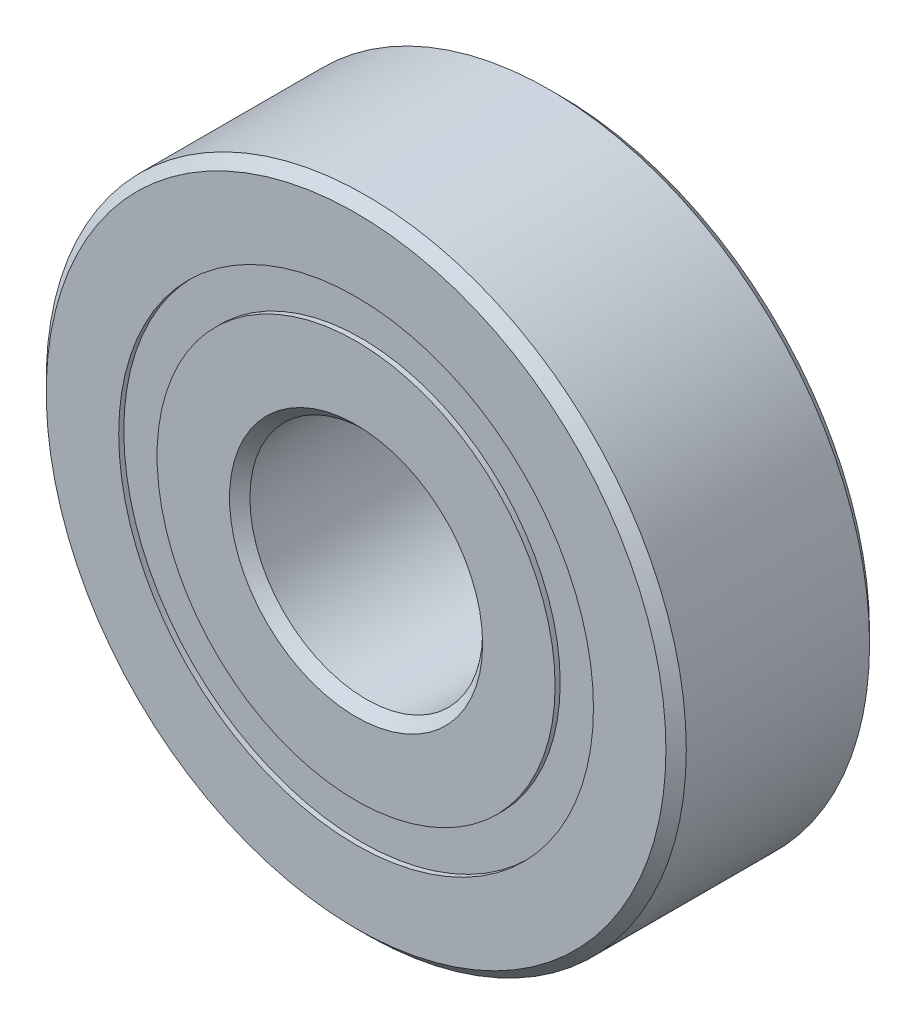
ISO-10303-21;
HEADER;
FILE_DESCRIPTION(('STEP AP214'),'2;1');
FILE_NAME('part.step','',(''),(''),'','','');
FILE_SCHEMA(('AUTOMOTIVE_DESIGN { 1 0 10303 214 1 1 1 1 }'));
ENDSEC;
DATA;
#1=APPLICATION_CONTEXT('core data for automotive mechanical design processes');
#2=APPLICATION_PROTOCOL_DEFINITION('international standard','automotive_design',2000,#1);
#3=PRODUCT_CONTEXT('',#1,'mechanical');
#4=PRODUCT('Part','Part','',(#3));
#5=PRODUCT_RELATED_PRODUCT_CATEGORY('part','',(#4));
#6=PRODUCT_DEFINITION_FORMATION('','',#4);
#7=PRODUCT_DEFINITION_CONTEXT('part definition',#1,'design');
#8=PRODUCT_DEFINITION('design','',#6,#7);
#9=PRODUCT_DEFINITION_SHAPE('','',#8);
#10=(LENGTH_UNIT() NAMED_UNIT(*) SI_UNIT(.MILLI.,.METRE.));
#11=(NAMED_UNIT(*) PLANE_ANGLE_UNIT() SI_UNIT($,.RADIAN.));
#12=(NAMED_UNIT(*) SI_UNIT($,.STERADIAN.) SOLID_ANGLE_UNIT());
#13=UNCERTAINTY_MEASURE_WITH_UNIT(LENGTH_MEASURE(1.E-05),#10,'distance_accuracy_value','');
#14=(GEOMETRIC_REPRESENTATION_CONTEXT(3) GLOBAL_UNCERTAINTY_ASSIGNED_CONTEXT((#13)) GLOBAL_UNIT_ASSIGNED_CONTEXT((#10,
#11,#12)) REPRESENTATION_CONTEXT('',''));
#15=CARTESIAN_POINT('',(0.,0.,0.));
#16=DIRECTION('',(0.,0.,1.));
#17=DIRECTION('',(1.,0.,0.));
#18=AXIS2_PLACEMENT_3D('',#15,#16,#17);
#19=CARTESIAN_POINT('',(0.,8.15934065934066,-3.325));
#20=DIRECTION('',(0.,0.,1.));
#21=DIRECTION('',(1.,0.,0.));
#22=AXIS2_PLACEMENT_3D('',#19,#20,#21);
#23=PLANE('',#22);
#24=CARTESIAN_POINT('',(0.,0.,-3.325));
#25=DIRECTION('',(0.,0.,1.));
#26=DIRECTION('',(1.,0.,0.));
#27=AXIS2_PLACEMENT_3D('',#24,#25,#26);
#28=CIRCLE('',#27,8.15934065934066);
#29=CARTESIAN_POINT('',(8.15934065934066,0.,-3.325));
#30=VERTEX_POINT('',#29);
#31=EDGE_CURVE('E70',#30,#30,#28,.T.);
#32=ORIENTED_EDGE('',*,*,#31,.F.);
#33=EDGE_LOOP('',(#32));
#34=FACE_BOUND('',#33,.T.);
#35=CARTESIAN_POINT('',(0.,0.,-3.325));
#36=DIRECTION('',(0.,0.,1.));
#37=DIRECTION('',(1.,0.,0.));
#38=AXIS2_PLACEMENT_3D('',#35,#36,#37);
#39=CIRCLE('',#38,6.84065934065934);
#40=CARTESIAN_POINT('',(6.84065934065934,0.,-3.325));
#41=VERTEX_POINT('',#40);
#42=EDGE_CURVE('E11',#41,#41,#39,.T.);
#43=ORIENTED_EDGE('',*,*,#42,.T.);
#44=EDGE_LOOP('',(#43));
#45=FACE_BOUND('',#44,.T.);
#46=ADVANCED_FACE('F56',(#34,#45),#23,.F.);
#47=CARTESIAN_POINT('',(0.,0.,3.5));
#48=DIRECTION('',(0.,0.,1.));
#49=DIRECTION('',(1.,0.,0.));
#50=AXIS2_PLACEMENT_3D('',#47,#48,#49);
#51=CYLINDRICAL_SURFACE('',#50,6.84065934065934);
#52=ORIENTED_EDGE('',*,*,#42,.F.);
#53=EDGE_LOOP('',(#52));
#54=FACE_BOUND('',#53,.T.);
#55=CARTESIAN_POINT('',(0.,0.,-1.68952158656809));
#56=DIRECTION('',(0.,0.,1.));
#57=DIRECTION('',(1.,0.,0.));
#58=AXIS2_PLACEMENT_3D('',#55,#56,#57);
#59=CIRCLE('',#58,6.84065934065934);
#60=CARTESIAN_POINT('',(6.84065934065934,0.,-1.68952158656809));
#61=VERTEX_POINT('',#60);
#62=EDGE_CURVE('E62',#61,#61,#59,.T.);
#63=ORIENTED_EDGE('',*,*,#62,.T.);
#64=EDGE_LOOP('',(#63));
#65=FACE_BOUND('',#64,.T.);
#66=ADVANCED_FACE('F79',(#54,#65),#51,.F.);
#67=CARTESIAN_POINT('',(0.,8.15934065934066,-1.68952158656809));
#68=DIRECTION('',(0.,0.,-1.));
#69=DIRECTION('',(-1.,0.,0.));
#70=AXIS2_PLACEMENT_3D('',#67,#68,#69);
#71=PLANE('',#70);
#72=ORIENTED_EDGE('',*,*,#62,.F.);
#73=EDGE_LOOP('',(#72));
#74=FACE_BOUND('',#73,.T.);
#75=CARTESIAN_POINT('',(0.,0.,-1.68952158656809));
#76=DIRECTION('',(0.,0.,1.));
#77=DIRECTION('',(1.,0.,0.));
#78=AXIS2_PLACEMENT_3D('',#75,#76,#77);
#79=CIRCLE('',#78,8.15934065934066);
#80=CARTESIAN_POINT('',(8.15934065934066,0.,-1.68952158656809));
#81=VERTEX_POINT('',#80);
#82=EDGE_CURVE('E66',#81,#81,#79,.T.);
#83=ORIENTED_EDGE('',*,*,#82,.T.);
#84=EDGE_LOOP('',(#83));
#85=FACE_BOUND('',#84,.T.);
#86=ADVANCED_FACE('F84',(#74,#85),#71,.F.);
#87=CARTESIAN_POINT('',(0.,0.,3.5));
#88=DIRECTION('',(0.,0.,1.));
#89=DIRECTION('',(1.,0.,0.));
#90=AXIS2_PLACEMENT_3D('',#87,#88,#89);
#91=CYLINDRICAL_SURFACE('',#90,8.15934065934066);
#92=ORIENTED_EDGE('',*,*,#82,.F.);
#93=EDGE_LOOP('',(#92));
#94=FACE_BOUND('',#93,.T.);
#95=ORIENTED_EDGE('',*,*,#31,.T.);
#96=EDGE_LOOP('',(#95));
#97=FACE_BOUND('',#96,.T.);
#98=ADVANCED_FACE('F76',(#94,#97),#91,.T.);
#99=CLOSED_SHELL('',(#46,#66,#86,#98));
#100=MANIFOLD_SOLID_BREP('B2',#99);
#101=CARTESIAN_POINT('',(0.,8.15934065934066,3.32499999999999));
#102=DIRECTION('',(0.,0.,-1.));
#103=DIRECTION('',(-1.,0.,0.));
#104=AXIS2_PLACEMENT_3D('',#101,#102,#103);
#105=PLANE('',#104);
#106=CARTESIAN_POINT('',(0.,0.,3.32499999999999));
#107=DIRECTION('',(0.,0.,1.));
#108=DIRECTION('',(1.,0.,0.));
#109=AXIS2_PLACEMENT_3D('',#106,#107,#108);
#110=CIRCLE('',#109,6.84065934065934);
#111=CARTESIAN_POINT('',(6.84065934065934,0.,3.32499999999999));
#112=VERTEX_POINT('',#111);
#113=EDGE_CURVE('E55',#112,#112,#110,.T.);
#114=ORIENTED_EDGE('',*,*,#113,.F.);
#115=EDGE_LOOP('',(#114));
#116=FACE_BOUND('',#115,.T.);
#117=CARTESIAN_POINT('',(0.,0.,3.32499999999999));
#118=DIRECTION('',(0.,0.,1.));
#119=DIRECTION('',(1.,0.,0.));
#120=AXIS2_PLACEMENT_3D('',#117,#118,#119);
#121=CIRCLE('',#120,8.15934065934066);
#122=CARTESIAN_POINT('',(8.15934065934066,0.,3.32499999999999));
#123=VERTEX_POINT('',#122);
#124=EDGE_CURVE('E133',#123,#123,#121,.T.);
#125=ORIENTED_EDGE('',*,*,#124,.T.);
#126=EDGE_LOOP('',(#125));
#127=FACE_BOUND('',#126,.T.);
#128=ADVANCED_FACE('F119',(#116,#127),#105,.F.);
#129=CARTESIAN_POINT('',(0.,0.,3.5));
#130=DIRECTION('',(0.,0.,1.));
#131=DIRECTION('',(1.,0.,0.));
#132=AXIS2_PLACEMENT_3D('',#129,#130,#131);
#133=CYLINDRICAL_SURFACE('',#132,6.84065934065934);
#134=CARTESIAN_POINT('',(0.,0.,1.68952158656808));
#135=DIRECTION('',(0.,0.,1.));
#136=DIRECTION('',(1.,0.,0.));
#137=AXIS2_PLACEMENT_3D('',#134,#135,#136);
#138=CIRCLE('',#137,6.84065934065934);
#139=CARTESIAN_POINT('',(6.84065934065934,0.,1.68952158656808));
#140=VERTEX_POINT('',#139);
#141=EDGE_CURVE('E125',#140,#140,#138,.T.);
#142=ORIENTED_EDGE('',*,*,#141,.F.);
#143=EDGE_LOOP('',(#142));
#144=FACE_BOUND('',#143,.T.);
#145=ORIENTED_EDGE('',*,*,#113,.T.);
#146=EDGE_LOOP('',(#145));
#147=FACE_BOUND('',#146,.T.);
#148=ADVANCED_FACE('F148',(#144,#147),#133,.F.);
#149=CARTESIAN_POINT('',(0.,8.15934065934066,1.68952158656808));
#150=DIRECTION('',(0.,0.,1.));
#151=DIRECTION('',(1.,0.,0.));
#152=AXIS2_PLACEMENT_3D('',#149,#150,#151);
#153=PLANE('',#152);
#154=CARTESIAN_POINT('',(0.,0.,1.68952158656808));
#155=DIRECTION('',(0.,0.,1.));
#156=DIRECTION('',(1.,0.,0.));
#157=AXIS2_PLACEMENT_3D('',#154,#155,#156);
#158=CIRCLE('',#157,8.15934065934066);
#159=CARTESIAN_POINT('',(8.15934065934066,0.,1.68952158656808));
#160=VERTEX_POINT('',#159);
#161=EDGE_CURVE('E129',#160,#160,#158,.T.);
#162=ORIENTED_EDGE('',*,*,#161,.F.);
#163=EDGE_LOOP('',(#162));
#164=FACE_BOUND('',#163,.T.);
#165=ORIENTED_EDGE('',*,*,#141,.T.);
#166=EDGE_LOOP('',(#165));
#167=FACE_BOUND('',#166,.T.);
#168=ADVANCED_FACE('F143',(#164,#167),#153,.F.);
#169=CARTESIAN_POINT('',(0.,0.,3.5));
#170=DIRECTION('',(0.,0.,1.));
#171=DIRECTION('',(1.,0.,0.));
#172=AXIS2_PLACEMENT_3D('',#169,#170,#171);
#173=CYLINDRICAL_SURFACE('',#172,8.15934065934066);
#174=ORIENTED_EDGE('',*,*,#124,.F.);
#175=EDGE_LOOP('',(#174));
#176=FACE_BOUND('',#175,.T.);
#177=ORIENTED_EDGE('',*,*,#161,.T.);
#178=EDGE_LOOP('',(#177));
#179=FACE_BOUND('',#178,.T.);
#180=ADVANCED_FACE('F140',(#176,#179),#173,.T.);
#181=CLOSED_SHELL('',(#128,#148,#168,#180));
#182=MANIFOLD_SOLID_BREP('B6',#181);
#183=CARTESIAN_POINT('',(-3.2541280433816,6.75726650926819,0.));
#184=DIRECTION('',(0.,0.,1.));
#185=DIRECTION('',(-0.433883739117546,0.900968867902425,0.));
#186=AXIS2_PLACEMENT_3D('',#183,#184,#185);
#187=SPHERICAL_SURFACE('',#186,1.68952158656808);
#188=CARTESIAN_POINT('',(-3.2541280433816,6.75726650926819,1.68952158656808));
#189=VERTEX_POINT('',#188);
#190=VERTEX_LOOP('',#189);
#191=FACE_BOUND('',#190,.T.);
#192=ADVANCED_FACE('F182',(#191),#187,.T.);
#193=CLOSED_SHELL('',(#192));
#194=MANIFOLD_SOLID_BREP('B50',#193);
#195=CARTESIAN_POINT('',(-5.86373611851017,4.67617351394057,0.));
#196=DIRECTION('',(0.,0.,1.));
#197=DIRECTION('',(-0.781831482468022,0.623489801858743,0.));
#198=AXIS2_PLACEMENT_3D('',#195,#196,#197);
#199=SPHERICAL_SURFACE('',#198,1.68952158656808);
#200=CARTESIAN_POINT('',(-5.86373611851017,4.67617351394057,1.68952158656808));
#201=VERTEX_POINT('',#200);
#202=VERTEX_LOOP('',#201);
#203=FACE_BOUND('',#202,.T.);
#204=ADVANCED_FACE('F225',(#203),#199,.T.);
#205=CLOSED_SHELL('',(#204));
#206=MANIFOLD_SOLID_BREP('B115',#205);
#207=CARTESIAN_POINT('',(-7.31195934136366,1.66890700467243,0.));
#208=DIRECTION('',(0.,0.,1.));
#209=DIRECTION('',(-0.974927912181821,0.222520933956325,0.));
#210=AXIS2_PLACEMENT_3D('',#207,#208,#209);
#211=SPHERICAL_SURFACE('',#210,1.68952158656808);
#212=CARTESIAN_POINT('',(-7.31195934136366,1.66890700467243,1.68952158656808));
#213=VERTEX_POINT('',#212);
#214=VERTEX_LOOP('',#213);
#215=FACE_BOUND('',#214,.T.);
#216=ADVANCED_FACE('F268',(#215),#211,.T.);
#217=CLOSED_SHELL('',(#216));
#218=MANIFOLD_SOLID_BREP('B178',#217);
#219=CARTESIAN_POINT('',(-7.31195934136369,-1.66890700467229,0.));
#220=DIRECTION('',(0.,0.,1.));
#221=DIRECTION('',(-0.974927912181826,-0.222520933956305,0.));
#222=AXIS2_PLACEMENT_3D('',#219,#220,#221);
#223=SPHERICAL_SURFACE('',#222,1.68952158656808);
#224=CARTESIAN_POINT('',(-7.31195934136369,-1.66890700467229,1.68952158656808));
#225=VERTEX_POINT('',#224);
#226=VERTEX_LOOP('',#225);
#227=FACE_BOUND('',#226,.T.);
#228=ADVANCED_FACE('F311',(#227),#223,.T.);
#229=CLOSED_SHELL('',(#228));
#230=MANIFOLD_SOLID_BREP('B221',#229);
#231=CARTESIAN_POINT('',(-5.86373611851026,-4.67617351394045,0.));
#232=DIRECTION('',(0.,0.,1.));
#233=DIRECTION('',(-0.781831482468035,-0.623489801858727,0.));
#234=AXIS2_PLACEMENT_3D('',#231,#232,#233);
#235=SPHERICAL_SURFACE('',#234,1.68952158656808);
#236=CARTESIAN_POINT('',(-5.86373611851026,-4.67617351394045,1.68952158656808));
#237=VERTEX_POINT('',#236);
#238=VERTEX_LOOP('',#237);
#239=FACE_BOUND('',#238,.T.);
#240=ADVANCED_FACE('F354',(#239),#235,.T.);
#241=CLOSED_SHELL('',(#240));
#242=MANIFOLD_SOLID_BREP('B264',#241);
#243=CARTESIAN_POINT('',(-3.25412804338174,-6.75726650926812,0.));
#244=DIRECTION('',(0.,0.,1.));
#245=DIRECTION('',(-0.433883739117565,-0.900968867902416,0.));
#246=AXIS2_PLACEMENT_3D('',#243,#244,#245);
#247=SPHERICAL_SURFACE('',#246,1.68952158656808);
#248=CARTESIAN_POINT('',(-3.25412804338174,-6.75726650926812,1.68952158656808));
#249=VERTEX_POINT('',#248);
#250=VERTEX_LOOP('',#249);
#251=FACE_BOUND('',#250,.T.);
#252=ADVANCED_FACE('F397',(#251),#247,.T.);
#253=CLOSED_SHELL('',(#252));
#254=MANIFOLD_SOLID_BREP('B307',#253);
#255=CARTESIAN_POINT('',(0.,-7.5,0.));
#256=DIRECTION('',(0.,0.,1.));
#257=DIRECTION('',(0.,-1.,0.));
#258=AXIS2_PLACEMENT_3D('',#255,#256,#257);
#259=SPHERICAL_SURFACE('',#258,1.68952158656808);
#260=CARTESIAN_POINT('',(0.,-7.5,1.68952158656808));
#261=VERTEX_POINT('',#260);
#262=VERTEX_LOOP('',#261);
#263=FACE_BOUND('',#262,.T.);
#264=ADVANCED_FACE('F440',(#263),#259,.T.);
#265=CLOSED_SHELL('',(#264));
#266=MANIFOLD_SOLID_BREP('B350',#265);
#267=CARTESIAN_POINT('',(3.25412804338164,-6.75726650926816,0.));
#268=DIRECTION('',(0.,0.,1.));
#269=DIRECTION('',(0.433883739117553,-0.900968867902422,0.));
#270=AXIS2_PLACEMENT_3D('',#267,#268,#269);
#271=SPHERICAL_SURFACE('',#270,1.68952158656808);
#272=CARTESIAN_POINT('',(3.25412804338164,-6.75726650926816,1.68952158656808));
#273=VERTEX_POINT('',#272);
#274=VERTEX_LOOP('',#273);
#275=FACE_BOUND('',#274,.T.);
#276=ADVANCED_FACE('F483',(#275),#271,.T.);
#277=CLOSED_SHELL('',(#276));
#278=MANIFOLD_SOLID_BREP('B393',#277);
#279=CARTESIAN_POINT('',(5.8637361185102,-4.67617351394053,0.));
#280=DIRECTION('',(0.,0.,1.));
#281=DIRECTION('',(0.781831482468027,-0.623489801858737,0.));
#282=AXIS2_PLACEMENT_3D('',#279,#280,#281);
#283=SPHERICAL_SURFACE('',#282,1.68952158656808);
#284=CARTESIAN_POINT('',(5.8637361185102,-4.67617351394053,1.68952158656808));
#285=VERTEX_POINT('',#284);
#286=VERTEX_LOOP('',#285);
#287=FACE_BOUND('',#286,.T.);
#288=ADVANCED_FACE('F526',(#287),#283,.T.);
#289=CLOSED_SHELL('',(#288));
#290=MANIFOLD_SOLID_BREP('B436',#289);
#291=CARTESIAN_POINT('',(7.31195934136367,-1.66890700467239,0.));
#292=DIRECTION('',(0.,0.,1.));
#293=DIRECTION('',(0.974927912181823,-0.222520933956318,0.));
#294=AXIS2_PLACEMENT_3D('',#291,#292,#293);
#295=SPHERICAL_SURFACE('',#294,1.68952158656808);
#296=CARTESIAN_POINT('',(7.31195934136367,-1.66890700467239,1.68952158656808));
#297=VERTEX_POINT('',#296);
#298=VERTEX_LOOP('',#297);
#299=FACE_BOUND('',#298,.T.);
#300=ADVANCED_FACE('F569',(#299),#295,.T.);
#301=CLOSED_SHELL('',(#300));
#302=MANIFOLD_SOLID_BREP('B479',#301);
#303=CARTESIAN_POINT('',(7.31195934136368,1.66890700467234,0.));
#304=DIRECTION('',(0.,0.,1.));
#305=DIRECTION('',(0.974927912181824,0.222520933956311,0.));
#306=AXIS2_PLACEMENT_3D('',#303,#304,#305);
#307=SPHERICAL_SURFACE('',#306,1.68952158656808);
#308=CARTESIAN_POINT('',(7.31195934136368,1.66890700467234,1.68952158656808));
#309=VERTEX_POINT('',#308);
#310=VERTEX_LOOP('',#309);
#311=FACE_BOUND('',#310,.T.);
#312=ADVANCED_FACE('F612',(#311),#307,.T.);
#313=CLOSED_SHELL('',(#312));
#314=MANIFOLD_SOLID_BREP('B522',#313);
#315=CARTESIAN_POINT('',(5.86373611851023,4.67617351394049,0.));
#316=DIRECTION('',(0.,0.,1.));
#317=DIRECTION('',(0.781831482468031,0.623489801858732,0.));
#318=AXIS2_PLACEMENT_3D('',#315,#316,#317);
#319=SPHERICAL_SURFACE('',#318,1.68952158656808);
#320=CARTESIAN_POINT('',(5.86373611851023,4.67617351394049,1.68952158656808));
#321=VERTEX_POINT('',#320);
#322=VERTEX_LOOP('',#321);
#323=FACE_BOUND('',#322,.T.);
#324=ADVANCED_FACE('F655',(#323),#319,.T.);
#325=CLOSED_SHELL('',(#324));
#326=MANIFOLD_SOLID_BREP('B565',#325);
#327=CARTESIAN_POINT('',(3.25412804338169,6.75726650926814,0.));
#328=DIRECTION('',(0.,0.,1.));
#329=DIRECTION('',(0.433883739117559,0.900968867902419,0.));
#330=AXIS2_PLACEMENT_3D('',#327,#328,#329);
#331=SPHERICAL_SURFACE('',#330,1.68952158656808);
#332=CARTESIAN_POINT('',(3.25412804338169,6.75726650926814,1.68952158656808));
#333=VERTEX_POINT('',#332);
#334=VERTEX_LOOP('',#333);
#335=FACE_BOUND('',#334,.T.);
#336=ADVANCED_FACE('F698',(#335),#331,.T.);
#337=CLOSED_SHELL('',(#336));
#338=MANIFOLD_SOLID_BREP('B608',#337);
#339=CARTESIAN_POINT('',(0.,7.5,0.));
#340=DIRECTION('',(0.,0.,1.));
#341=DIRECTION('',(0.,1.,0.));
#342=AXIS2_PLACEMENT_3D('',#339,#340,#341);
#343=SPHERICAL_SURFACE('',#342,1.68952158656808);
#344=CARTESIAN_POINT('',(0.,7.5,1.68952158656808));
#345=VERTEX_POINT('',#344);
#346=VERTEX_LOOP('',#345);
#347=FACE_BOUND('',#346,.T.);
#348=ADVANCED_FACE('F743',(#347),#343,.T.);
#349=CLOSED_SHELL('',(#348));
#350=MANIFOLD_SOLID_BREP('B651',#349);
#351=CARTESIAN_POINT('',(0.,6.84065934065934,3.5));
#352=DIRECTION('',(0.,0.,-1.));
#353=DIRECTION('',(-1.,0.,0.));
#354=AXIS2_PLACEMENT_3D('',#351,#352,#353);
#355=PLANE('',#354);
#356=CARTESIAN_POINT('',(0.,0.,3.5));
#357=DIRECTION('',(0.,0.,1.));
#358=DIRECTION('',(1.,0.,0.));
#359=AXIS2_PLACEMENT_3D('',#356,#357,#358);
#360=CIRCLE('',#359,4.35);
#361=CARTESIAN_POINT('',(4.35,0.,3.5));
#362=VERTEX_POINT('',#361);
#363=EDGE_CURVE('E790',#362,#362,#360,.T.);
#364=ORIENTED_EDGE('',*,*,#363,.F.);
#365=EDGE_LOOP('',(#364));
#366=FACE_BOUND('',#365,.T.);
#367=CARTESIAN_POINT('',(0.,0.,3.50000000000001));
#368=DIRECTION('',(0.,0.,1.));
#369=DIRECTION('',(1.,0.,0.));
#370=AXIS2_PLACEMENT_3D('',#367,#368,#369);
#371=CIRCLE('',#370,6.84065934065934);
#372=CARTESIAN_POINT('',(6.84065934065934,0.,3.50000000000001));
#373=VERTEX_POINT('',#372);
#374=EDGE_CURVE('E742',#373,#373,#371,.T.);
#375=ORIENTED_EDGE('',*,*,#374,.T.);
#376=EDGE_LOOP('',(#375));
#377=FACE_BOUND('',#376,.T.);
#378=ADVANCED_FACE('F762',(#366,#377),#355,.F.);
#379=CARTESIAN_POINT('',(0.,0.,3.5));
#380=DIRECTION('',(0.,0.,1.));
#381=DIRECTION('',(1.,0.,0.));
#382=AXIS2_PLACEMENT_3D('',#379,#380,#381);
#383=CYLINDRICAL_SURFACE('',#382,6.84065934065934);
#384=ORIENTED_EDGE('',*,*,#374,.F.);
#385=EDGE_LOOP('',(#384));
#386=FACE_BOUND('',#385,.T.);
#387=CARTESIAN_POINT('',(0.,0.,1.55555555555555));
#388=DIRECTION('',(0.,0.,1.));
#389=DIRECTION('',(1.,0.,0.));
#390=AXIS2_PLACEMENT_3D('',#387,#388,#389);
#391=CIRCLE('',#390,6.84065934065934);
#392=CARTESIAN_POINT('',(6.84065934065934,0.,1.55555555555555));
#393=VERTEX_POINT('',#392);
#394=EDGE_CURVE('E768',#393,#393,#391,.T.);
#395=ORIENTED_EDGE('',*,*,#394,.T.);
#396=EDGE_LOOP('',(#395));
#397=FACE_BOUND('',#396,.T.);
#398=ADVANCED_FACE('F797',(#386,#397),#383,.T.);
#399=CARTESIAN_POINT('',(0.,0.,0.));
#400=DIRECTION('',(0.,0.,1.));
#401=DIRECTION('',(1.,0.,0.));
#402=AXIS2_PLACEMENT_3D('',#399,#400,#401);
#403=TOROIDAL_SURFACE('',#402,7.5,1.68952158656808);
#404=ORIENTED_EDGE('',*,*,#394,.F.);
#405=EDGE_LOOP('',(#404));
#406=FACE_BOUND('',#405,.T.);
#407=CARTESIAN_POINT('',(0.,0.,-1.55555555555556));
#408=DIRECTION('',(0.,0.,1.));
#409=DIRECTION('',(1.,0.,0.));
#410=AXIS2_PLACEMENT_3D('',#407,#408,#409);
#411=CIRCLE('',#410,6.84065934065934);
#412=CARTESIAN_POINT('',(6.84065934065934,0.,-1.55555555555556));
#413=VERTEX_POINT('',#412);
#414=EDGE_CURVE('E772',#413,#413,#411,.T.);
#415=ORIENTED_EDGE('',*,*,#414,.T.);
#416=EDGE_LOOP('',(#415));
#417=FACE_BOUND('',#416,.T.);
#418=ADVANCED_FACE('F800',(#406,#417),#403,.F.);
#419=CARTESIAN_POINT('',(0.,0.,3.5));
#420=DIRECTION('',(0.,0.,1.));
#421=DIRECTION('',(1.,0.,0.));
#422=AXIS2_PLACEMENT_3D('',#419,#420,#421);
#423=CYLINDRICAL_SURFACE('',#422,6.84065934065934);
#424=ORIENTED_EDGE('',*,*,#414,.F.);
#425=EDGE_LOOP('',(#424));
#426=FACE_BOUND('',#425,.T.);
#427=CARTESIAN_POINT('',(0.,0.,-3.50000000000001));
#428=DIRECTION('',(0.,0.,1.));
#429=DIRECTION('',(1.,0.,0.));
#430=AXIS2_PLACEMENT_3D('',#427,#428,#429);
#431=CIRCLE('',#430,6.84065934065934);
#432=CARTESIAN_POINT('',(6.84065934065934,0.,-3.50000000000001));
#433=VERTEX_POINT('',#432);
#434=EDGE_CURVE('E776',#433,#433,#431,.T.);
#435=ORIENTED_EDGE('',*,*,#434,.T.);
#436=EDGE_LOOP('',(#435));
#437=FACE_BOUND('',#436,.T.);
#438=ADVANCED_FACE('F804',(#426,#437),#423,.T.);
#439=CARTESIAN_POINT('',(0.,4.34999999999999,-3.50000000000001));
#440=DIRECTION('',(0.,0.,1.));
#441=DIRECTION('',(1.,0.,0.));
#442=AXIS2_PLACEMENT_3D('',#439,#440,#441);
#443=PLANE('',#442);
#444=ORIENTED_EDGE('',*,*,#434,.F.);
#445=EDGE_LOOP('',(#444));
#446=FACE_BOUND('',#445,.T.);
#447=CARTESIAN_POINT('',(0.,0.,-3.50000000000001));
#448=DIRECTION('',(0.,0.,1.));
#449=DIRECTION('',(1.,0.,0.));
#450=AXIS2_PLACEMENT_3D('',#447,#448,#449);
#451=CIRCLE('',#450,4.34999999999999);
#452=CARTESIAN_POINT('',(4.34999999999999,0.,-3.50000000000001));
#453=VERTEX_POINT('',#452);
#454=EDGE_CURVE('E781',#453,#453,#451,.T.);
#455=ORIENTED_EDGE('',*,*,#454,.T.);
#456=EDGE_LOOP('',(#455));
#457=FACE_BOUND('',#456,.T.);
#458=ADVANCED_FACE('F810',(#446,#457),#443,.F.);
#459=CARTESIAN_POINT('',(0.,0.,-3.15000000000001));
#460=DIRECTION('',(0.,0.,-1.));
#461=DIRECTION('',(-1.,0.,0.));
#462=AXIS2_PLACEMENT_3D('',#459,#460,#461);
#463=CONICAL_SURFACE('',#462,4.,0.785398163397433);
#464=ORIENTED_EDGE('',*,*,#454,.F.);
#465=EDGE_LOOP('',(#464));
#466=FACE_BOUND('',#465,.T.);
#467=CARTESIAN_POINT('',(0.,0.,-3.15000000000001));
#468=DIRECTION('',(0.,0.,1.));
#469=DIRECTION('',(1.,0.,0.));
#470=AXIS2_PLACEMENT_3D('',#467,#468,#469);
#471=CIRCLE('',#470,4.);
#472=CARTESIAN_POINT('',(4.,0.,-3.15000000000001));
#473=VERTEX_POINT('',#472);
#474=EDGE_CURVE('E784',#473,#473,#471,.T.);
#475=ORIENTED_EDGE('',*,*,#474,.T.);
#476=EDGE_LOOP('',(#475));
#477=FACE_BOUND('',#476,.T.);
#478=ADVANCED_FACE('F814',(#466,#477),#463,.F.);
#479=CARTESIAN_POINT('',(0.,0.,3.5));
#480=DIRECTION('',(0.,0.,1.));
#481=DIRECTION('',(1.,0.,0.));
#482=AXIS2_PLACEMENT_3D('',#479,#480,#481);
#483=CYLINDRICAL_SURFACE('',#482,4.);
#484=ORIENTED_EDGE('',*,*,#474,.F.);
#485=EDGE_LOOP('',(#484));
#486=FACE_BOUND('',#485,.T.);
#487=CARTESIAN_POINT('',(0.,0.,3.15000000000001));
#488=DIRECTION('',(0.,0.,1.));
#489=DIRECTION('',(1.,0.,0.));
#490=AXIS2_PLACEMENT_3D('',#487,#488,#489);
#491=CIRCLE('',#490,4.);
#492=CARTESIAN_POINT('',(4.,0.,3.15000000000001));
#493=VERTEX_POINT('',#492);
#494=EDGE_CURVE('E787',#493,#493,#491,.T.);
#495=ORIENTED_EDGE('',*,*,#494,.T.);
#496=EDGE_LOOP('',(#495));
#497=FACE_BOUND('',#496,.T.);
#498=ADVANCED_FACE('F818',(#486,#497),#483,.F.);
#499=CARTESIAN_POINT('',(0.,0.,3.5));
#500=DIRECTION('',(0.,0.,1.));
#501=DIRECTION('',(1.,0.,0.));
#502=AXIS2_PLACEMENT_3D('',#499,#500,#501);
#503=CONICAL_SURFACE('',#502,4.35,0.785398163397466);
#504=ORIENTED_EDGE('',*,*,#494,.F.);
#505=EDGE_LOOP('',(#504));
#506=FACE_BOUND('',#505,.T.);
#507=ORIENTED_EDGE('',*,*,#363,.T.);
#508=EDGE_LOOP('',(#507));
#509=FACE_BOUND('',#508,.T.);
#510=ADVANCED_FACE('F794',(#506,#509),#503,.F.);
#511=CLOSED_SHELL('',(#378,#398,#418,#438,#458,#478,#498,#510));
#512=MANIFOLD_SOLID_BREP('B694',#511);
#513=CARTESIAN_POINT('',(0.,0.,3.15));
#514=DIRECTION('',(0.,0.,-1.));
#515=DIRECTION('',(-1.,0.,0.));
#516=AXIS2_PLACEMENT_3D('',#513,#514,#515);
#517=CONICAL_SURFACE('',#516,11.,0.785398163397443);
#518=CARTESIAN_POINT('',(0.,0.,3.5));
#519=DIRECTION('',(0.,0.,1.));
#520=DIRECTION('',(1.,0.,0.));
#521=AXIS2_PLACEMENT_3D('',#518,#519,#520);
#522=CIRCLE('',#521,10.65);
#523=CARTESIAN_POINT('',(10.65,0.,3.5));
#524=VERTEX_POINT('',#523);
#525=EDGE_CURVE('E904',#524,#524,#522,.T.);
#526=ORIENTED_EDGE('',*,*,#525,.F.);
#527=EDGE_LOOP('',(#526));
#528=FACE_BOUND('',#527,.T.);
#529=CARTESIAN_POINT('',(0.,0.,3.15));
#530=DIRECTION('',(0.,0.,1.));
#531=DIRECTION('',(1.,0.,0.));
#532=AXIS2_PLACEMENT_3D('',#529,#530,#531);
#533=CIRCLE('',#532,11.);
#534=CARTESIAN_POINT('',(11.,0.,3.15));
#535=VERTEX_POINT('',#534);
#536=EDGE_CURVE('E761',#535,#535,#533,.T.);
#537=ORIENTED_EDGE('',*,*,#536,.T.);
#538=EDGE_LOOP('',(#537));
#539=FACE_BOUND('',#538,.T.);
#540=ADVANCED_FACE('F876',(#528,#539),#517,.T.);
#541=CARTESIAN_POINT('',(0.,0.,3.5));
#542=DIRECTION('',(0.,0.,1.));
#543=DIRECTION('',(1.,0.,0.));
#544=AXIS2_PLACEMENT_3D('',#541,#542,#543);
#545=CYLINDRICAL_SURFACE('',#544,11.);
#546=ORIENTED_EDGE('',*,*,#536,.F.);
#547=EDGE_LOOP('',(#546));
#548=FACE_BOUND('',#547,.T.);
#549=CARTESIAN_POINT('',(0.,0.,-3.15000000000001));
#550=DIRECTION('',(0.,0.,1.));
#551=DIRECTION('',(1.,0.,0.));
#552=AXIS2_PLACEMENT_3D('',#549,#550,#551);
#553=CIRCLE('',#552,11.);
#554=CARTESIAN_POINT('',(11.,0.,-3.15000000000001));
#555=VERTEX_POINT('',#554);
#556=EDGE_CURVE('E882',#555,#555,#553,.T.);
#557=ORIENTED_EDGE('',*,*,#556,.T.);
#558=EDGE_LOOP('',(#557));
#559=FACE_BOUND('',#558,.T.);
#560=ADVANCED_FACE('F911',(#548,#559),#545,.T.);
#561=CARTESIAN_POINT('',(0.,0.,-3.50000000000001));
#562=DIRECTION('',(0.,0.,1.));
#563=DIRECTION('',(1.,0.,0.));
#564=AXIS2_PLACEMENT_3D('',#561,#562,#563);
#565=CONICAL_SURFACE('',#564,10.65,0.785398163397443);
#566=ORIENTED_EDGE('',*,*,#556,.F.);
#567=EDGE_LOOP('',(#566));
#568=FACE_BOUND('',#567,.T.);
#569=CARTESIAN_POINT('',(0.,0.,-3.50000000000001));
#570=DIRECTION('',(0.,0.,1.));
#571=DIRECTION('',(1.,0.,0.));
#572=AXIS2_PLACEMENT_3D('',#569,#570,#571);
#573=CIRCLE('',#572,10.65);
#574=CARTESIAN_POINT('',(10.65,0.,-3.50000000000001));
#575=VERTEX_POINT('',#574);
#576=EDGE_CURVE('E886',#575,#575,#573,.T.);
#577=ORIENTED_EDGE('',*,*,#576,.T.);
#578=EDGE_LOOP('',(#577));
#579=FACE_BOUND('',#578,.T.);
#580=ADVANCED_FACE('F914',(#568,#579),#565,.T.);
#581=CARTESIAN_POINT('',(0.,10.65,-3.50000000000001));
#582=DIRECTION('',(0.,0.,1.));
#583=DIRECTION('',(1.,0.,0.));
#584=AXIS2_PLACEMENT_3D('',#581,#582,#583);
#585=PLANE('',#584);
#586=ORIENTED_EDGE('',*,*,#576,.F.);
#587=EDGE_LOOP('',(#586));
#588=FACE_BOUND('',#587,.T.);
#589=CARTESIAN_POINT('',(0.,0.,-3.50000000000001));
#590=DIRECTION('',(0.,0.,1.));
#591=DIRECTION('',(1.,0.,0.));
#592=AXIS2_PLACEMENT_3D('',#589,#590,#591);
#593=CIRCLE('',#592,8.15934065934066);
#594=CARTESIAN_POINT('',(8.15934065934066,0.,-3.50000000000001));
#595=VERTEX_POINT('',#594);
#596=EDGE_CURVE('E890',#595,#595,#593,.T.);
#597=ORIENTED_EDGE('',*,*,#596,.T.);
#598=EDGE_LOOP('',(#597));
#599=FACE_BOUND('',#598,.T.);
#600=ADVANCED_FACE('F918',(#588,#599),#585,.F.);
#601=CARTESIAN_POINT('',(0.,0.,3.5));
#602=DIRECTION('',(0.,0.,1.));
#603=DIRECTION('',(1.,0.,0.));
#604=AXIS2_PLACEMENT_3D('',#601,#602,#603);
#605=CYLINDRICAL_SURFACE('',#604,8.15934065934066);
#606=ORIENTED_EDGE('',*,*,#596,.F.);
#607=EDGE_LOOP('',(#606));
#608=FACE_BOUND('',#607,.T.);
#609=CARTESIAN_POINT('',(0.,0.,-1.55555555555556));
#610=DIRECTION('',(0.,0.,1.));
#611=DIRECTION('',(1.,0.,0.));
#612=AXIS2_PLACEMENT_3D('',#609,#610,#611);
#613=CIRCLE('',#612,8.15934065934066);
#614=CARTESIAN_POINT('',(8.15934065934066,0.,-1.55555555555556));
#615=VERTEX_POINT('',#614);
#616=EDGE_CURVE('E895',#615,#615,#613,.T.);
#617=ORIENTED_EDGE('',*,*,#616,.T.);
#618=EDGE_LOOP('',(#617));
#619=FACE_BOUND('',#618,.T.);
#620=ADVANCED_FACE('F924',(#608,#619),#605,.F.);
#621=CARTESIAN_POINT('',(0.,0.,0.));
#622=DIRECTION('',(0.,0.,1.));
#623=DIRECTION('',(1.,0.,0.));
#624=AXIS2_PLACEMENT_3D('',#621,#622,#623);
#625=TOROIDAL_SURFACE('',#624,7.5,1.68952158656808);
#626=ORIENTED_EDGE('',*,*,#616,.F.);
#627=EDGE_LOOP('',(#626));
#628=FACE_BOUND('',#627,.T.);
#629=CARTESIAN_POINT('',(0.,0.,1.55555555555555));
#630=DIRECTION('',(0.,0.,1.));
#631=DIRECTION('',(1.,0.,0.));
#632=AXIS2_PLACEMENT_3D('',#629,#630,#631);
#633=CIRCLE('',#632,8.15934065934066);
#634=CARTESIAN_POINT('',(8.15934065934066,0.,1.55555555555555));
#635=VERTEX_POINT('',#634);
#636=EDGE_CURVE('E898',#635,#635,#633,.T.);
#637=ORIENTED_EDGE('',*,*,#636,.T.);
#638=EDGE_LOOP('',(#637));
#639=FACE_BOUND('',#638,.T.);
#640=ADVANCED_FACE('F928',(#628,#639),#625,.F.);
#641=CARTESIAN_POINT('',(0.,0.,3.5));
#642=DIRECTION('',(0.,0.,1.));
#643=DIRECTION('',(1.,0.,0.));
#644=AXIS2_PLACEMENT_3D('',#641,#642,#643);
#645=CYLINDRICAL_SURFACE('',#644,8.15934065934066);
#646=ORIENTED_EDGE('',*,*,#636,.F.);
#647=EDGE_LOOP('',(#646));
#648=FACE_BOUND('',#647,.T.);
#649=CARTESIAN_POINT('',(0.,0.,3.5));
#650=DIRECTION('',(0.,0.,1.));
#651=DIRECTION('',(1.,0.,0.));
#652=AXIS2_PLACEMENT_3D('',#649,#650,#651);
#653=CIRCLE('',#652,8.15934065934066);
#654=CARTESIAN_POINT('',(8.15934065934066,0.,3.5));
#655=VERTEX_POINT('',#654);
#656=EDGE_CURVE('E901',#655,#655,#653,.T.);
#657=ORIENTED_EDGE('',*,*,#656,.T.);
#658=EDGE_LOOP('',(#657));
#659=FACE_BOUND('',#658,.T.);
#660=ADVANCED_FACE('F932',(#648,#659),#645,.F.);
#661=CARTESIAN_POINT('',(0.,10.65,3.5));
#662=DIRECTION('',(0.,0.,-1.));
#663=DIRECTION('',(-1.,0.,0.));
#664=AXIS2_PLACEMENT_3D('',#661,#662,#663);
#665=PLANE('',#664);
#666=ORIENTED_EDGE('',*,*,#656,.F.);
#667=EDGE_LOOP('',(#666));
#668=FACE_BOUND('',#667,.T.);
#669=ORIENTED_EDGE('',*,*,#525,.T.);
#670=EDGE_LOOP('',(#669));
#671=FACE_BOUND('',#670,.T.);
#672=ADVANCED_FACE('F908',(#668,#671),#665,.F.);
#673=CLOSED_SHELL('',(#540,#560,#580,#600,#620,#640,#660,#672));
#674=MANIFOLD_SOLID_BREP('B737',#673);
#675=ADVANCED_BREP_SHAPE_REPRESENTATION('',(#18,#100,#182,#194,#206,#218,#230,#242,#254,#266,
#278,#290,#302,#314,#326,#338,#350,#512,#674),#14);
#676=SHAPE_DEFINITION_REPRESENTATION(#9,#675);
ENDSEC;
END-ISO-10303-21;
